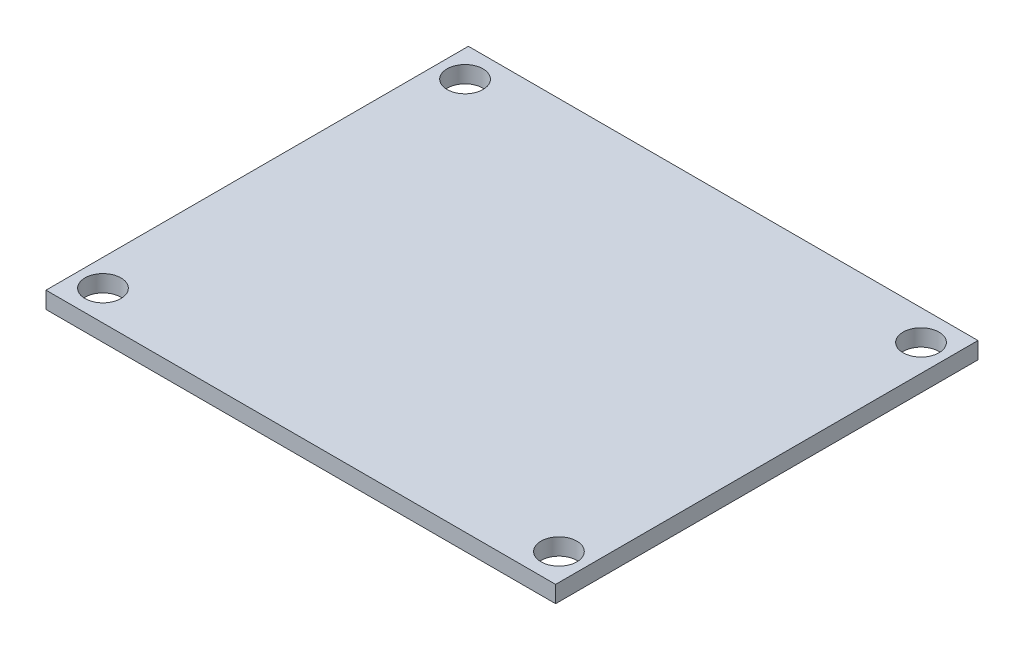
ISO-10303-21;
HEADER;
FILE_DESCRIPTION(('STEP AP214'),'2;1');
FILE_NAME('part.step','',(''),(''),'','','');
FILE_SCHEMA(('AUTOMOTIVE_DESIGN { 1 0 10303 214 1 1 1 1 }'));
ENDSEC;
DATA;
#1=APPLICATION_CONTEXT('core data for automotive mechanical design processes');
#2=APPLICATION_PROTOCOL_DEFINITION('international standard','automotive_design',2000,#1);
#3=PRODUCT_CONTEXT('',#1,'mechanical');
#4=PRODUCT('Part','Part','',(#3));
#5=PRODUCT_RELATED_PRODUCT_CATEGORY('part','',(#4));
#6=PRODUCT_DEFINITION_FORMATION('','',#4);
#7=PRODUCT_DEFINITION_CONTEXT('part definition',#1,'design');
#8=PRODUCT_DEFINITION('design','',#6,#7);
#9=PRODUCT_DEFINITION_SHAPE('','',#8);
#10=(LENGTH_UNIT() NAMED_UNIT(*) SI_UNIT(.MILLI.,.METRE.));
#11=(NAMED_UNIT(*) PLANE_ANGLE_UNIT() SI_UNIT($,.RADIAN.));
#12=(NAMED_UNIT(*) SI_UNIT($,.STERADIAN.) SOLID_ANGLE_UNIT());
#13=UNCERTAINTY_MEASURE_WITH_UNIT(LENGTH_MEASURE(1.E-05),#10,'distance_accuracy_value','');
#14=(GEOMETRIC_REPRESENTATION_CONTEXT(3) GLOBAL_UNCERTAINTY_ASSIGNED_CONTEXT((#13)) GLOBAL_UNIT_ASSIGNED_CONTEXT((#10,
#11,#12)) REPRESENTATION_CONTEXT('',''));
#15=CARTESIAN_POINT('',(0.,0.,0.));
#16=DIRECTION('',(0.,0.,1.));
#17=DIRECTION('',(1.,0.,0.));
#18=AXIS2_PLACEMENT_3D('',#15,#16,#17);
#19=CARTESIAN_POINT('',(-42.7686190505824,1.5875,-22.2551637593528));
#20=DIRECTION('',(1.,0.,0.));
#21=DIRECTION('',(0.,0.,-1.));
#22=AXIS2_PLACEMENT_3D('',#19,#20,#21);
#23=PLANE('',#22);
#24=DIRECTION('',(0.,0.,1.));
#25=VECTOR('',#24,1.);
#26=CARTESIAN_POINT('',(-42.7686190505824,0.,-22.2551637593528));
#27=LINE('',#26,#25);
#28=CARTESIAN_POINT('',(-42.7686190505824,0.,-22.2551637593528));
#29=VERTEX_POINT('',#28);
#30=CARTESIAN_POINT('',(-42.7686190505824,0.,17.7448362406472));
#31=VERTEX_POINT('',#30);
#32=EDGE_CURVE('E103',#29,#31,#27,.T.);
#33=ORIENTED_EDGE('',*,*,#32,.T.);
#34=DIRECTION('',(0.,-1.,0.));
#35=VECTOR('',#34,1.);
#36=CARTESIAN_POINT('',(-42.7686190505824,1.5875,17.7448362406472));
#37=LINE('',#36,#35);
#38=CARTESIAN_POINT('',(-42.7686190505824,1.5875,17.7448362406472));
#39=VERTEX_POINT('',#38);
#40=EDGE_CURVE('E94',#39,#31,#37,.T.);
#41=ORIENTED_EDGE('',*,*,#40,.F.);
#42=DIRECTION('',(0.,0.,1.));
#43=VECTOR('',#42,1.);
#44=CARTESIAN_POINT('',(-42.7686190505824,1.5875,-22.2551637593528));
#45=LINE('',#44,#43);
#46=CARTESIAN_POINT('',(-42.7686190505824,1.5875,-22.2551637593528));
#47=VERTEX_POINT('',#46);
#48=EDGE_CURVE('E88',#47,#39,#45,.T.);
#49=ORIENTED_EDGE('',*,*,#48,.F.);
#50=DIRECTION('',(0.,-1.,0.));
#51=VECTOR('',#50,1.);
#52=CARTESIAN_POINT('',(-42.7686190505824,1.5875,-22.2551637593528));
#53=LINE('',#52,#51);
#54=EDGE_CURVE('E99',#47,#29,#53,.T.);
#55=ORIENTED_EDGE('',*,*,#54,.T.);
#56=EDGE_LOOP('',(#33,#41,#49,#55));
#57=FACE_BOUND('',#56,.T.);
#58=ADVANCED_FACE('F34',(#57),#23,.F.);
#59=CARTESIAN_POINT('',(-42.7686190505824,1.5875,17.7448362406472));
#60=DIRECTION('',(0.,0.,-1.));
#61=DIRECTION('',(-1.,0.,0.));
#62=AXIS2_PLACEMENT_3D('',#59,#60,#61);
#63=PLANE('',#62);
#64=DIRECTION('',(1.,0.,0.));
#65=VECTOR('',#64,1.);
#66=CARTESIAN_POINT('',(-42.7686190505824,0.,17.7448362406472));
#67=LINE('',#66,#65);
#68=CARTESIAN_POINT('',(5.49138094941762,0.,17.7448362406472));
#69=VERTEX_POINT('',#68);
#70=EDGE_CURVE('E93',#31,#69,#67,.T.);
#71=ORIENTED_EDGE('',*,*,#70,.T.);
#72=DIRECTION('',(0.,-1.,0.));
#73=VECTOR('',#72,1.);
#74=CARTESIAN_POINT('',(5.49138094941762,1.5875,17.7448362406472));
#75=LINE('',#74,#73);
#76=CARTESIAN_POINT('',(5.49138094941762,1.5875,17.7448362406472));
#77=VERTEX_POINT('',#76);
#78=EDGE_CURVE('E91',#77,#69,#75,.T.);
#79=ORIENTED_EDGE('',*,*,#78,.F.);
#80=DIRECTION('',(1.,0.,0.));
#81=VECTOR('',#80,1.);
#82=CARTESIAN_POINT('',(-42.7686190505824,1.5875,17.7448362406472));
#83=LINE('',#82,#81);
#84=EDGE_CURVE('E82',#39,#77,#83,.T.);
#85=ORIENTED_EDGE('',*,*,#84,.F.);
#86=ORIENTED_EDGE('',*,*,#40,.T.);
#87=EDGE_LOOP('',(#71,#79,#85,#86));
#88=FACE_BOUND('',#87,.T.);
#89=ADVANCED_FACE('F92',(#88),#63,.F.);
#90=CARTESIAN_POINT('',(5.49138094941762,1.5875,-22.2551637593528));
#91=DIRECTION('',(-1.,0.,0.));
#92=DIRECTION('',(0.,0.,1.));
#93=AXIS2_PLACEMENT_3D('',#90,#91,#92);
#94=PLANE('',#93);
#95=DIRECTION('',(0.,0.,-1.));
#96=VECTOR('',#95,1.);
#97=CARTESIAN_POINT('',(5.49138094941762,0.,-22.2551637593528));
#98=LINE('',#97,#96);
#99=CARTESIAN_POINT('',(5.49138094941762,0.,-22.2551637593528));
#100=VERTEX_POINT('',#99);
#101=EDGE_CURVE('E68',#69,#100,#98,.T.);
#102=ORIENTED_EDGE('',*,*,#101,.T.);
#103=DIRECTION('',(0.,-1.,0.));
#104=VECTOR('',#103,1.);
#105=CARTESIAN_POINT('',(5.49138094941762,1.5875,-22.2551637593528));
#106=LINE('',#105,#104);
#107=CARTESIAN_POINT('',(5.49138094941762,1.5875,-22.2551637593528));
#108=VERTEX_POINT('',#107);
#109=EDGE_CURVE('E95',#108,#100,#106,.T.);
#110=ORIENTED_EDGE('',*,*,#109,.F.);
#111=DIRECTION('',(0.,0.,-1.));
#112=VECTOR('',#111,1.);
#113=CARTESIAN_POINT('',(5.49138094941762,1.5875,-22.2551637593528));
#114=LINE('',#113,#112);
#115=EDGE_CURVE('E86',#77,#108,#114,.T.);
#116=ORIENTED_EDGE('',*,*,#115,.F.);
#117=ORIENTED_EDGE('',*,*,#78,.T.);
#118=EDGE_LOOP('',(#102,#110,#116,#117));
#119=FACE_BOUND('',#118,.T.);
#120=ADVANCED_FACE('F97',(#119),#94,.F.);
#121=CARTESIAN_POINT('',(-42.7686190505824,1.5875,-22.2551637593528));
#122=DIRECTION('',(0.,0.,1.));
#123=DIRECTION('',(1.,0.,0.));
#124=AXIS2_PLACEMENT_3D('',#121,#122,#123);
#125=PLANE('',#124);
#126=DIRECTION('',(-1.,0.,0.));
#127=VECTOR('',#126,1.);
#128=CARTESIAN_POINT('',(-42.7686190505824,0.,-22.2551637593528));
#129=LINE('',#128,#127);
#130=EDGE_CURVE('E74',#100,#29,#129,.T.);
#131=ORIENTED_EDGE('',*,*,#130,.T.);
#132=ORIENTED_EDGE('',*,*,#54,.F.);
#133=DIRECTION('',(-1.,0.,0.));
#134=VECTOR('',#133,1.);
#135=CARTESIAN_POINT('',(-42.7686190505824,1.5875,-22.2551637593528));
#136=LINE('',#135,#134);
#137=EDGE_CURVE('E51',#108,#47,#136,.T.);
#138=ORIENTED_EDGE('',*,*,#137,.F.);
#139=ORIENTED_EDGE('',*,*,#109,.T.);
#140=EDGE_LOOP('',(#131,#132,#138,#139));
#141=FACE_BOUND('',#140,.T.);
#142=ADVANCED_FACE('F128',(#141),#125,.F.);
#143=CARTESIAN_POINT('',(-42.7686190505824,1.5875,17.7448362406472));
#144=DIRECTION('',(0.,1.,0.));
#145=DIRECTION('',(0.,0.,1.));
#146=AXIS2_PLACEMENT_3D('',#143,#144,#145);
#147=PLANE('',#146);
#148=CARTESIAN_POINT('',(2.95138094941762,1.5875,-19.4001637593528));
#149=DIRECTION('',(0.,1.,0.));
#150=DIRECTION('',(0.,0.,1.));
#151=AXIS2_PLACEMENT_3D('',#148,#149,#150);
#152=CIRCLE('',#151,1.7);
#153=CARTESIAN_POINT('',(2.95138094941762,1.5875,-17.7001637593528));
#154=VERTEX_POINT('',#153);
#155=EDGE_CURVE('E172',#154,#154,#152,.T.);
#156=ORIENTED_EDGE('',*,*,#155,.F.);
#157=EDGE_LOOP('',(#156));
#158=FACE_BOUND('',#157,.T.);
#159=CARTESIAN_POINT('',(-40.2286190505824,1.5875,-19.4001637593528));
#160=DIRECTION('',(0.,1.,0.));
#161=DIRECTION('',(0.,0.,1.));
#162=AXIS2_PLACEMENT_3D('',#159,#160,#161);
#163=CIRCLE('',#162,1.7);
#164=CARTESIAN_POINT('',(-40.2286190505824,1.5875,-17.7001637593528));
#165=VERTEX_POINT('',#164);
#166=EDGE_CURVE('E116',#165,#165,#163,.T.);
#167=ORIENTED_EDGE('',*,*,#166,.F.);
#168=EDGE_LOOP('',(#167));
#169=FACE_BOUND('',#168,.T.);
#170=ORIENTED_EDGE('',*,*,#48,.T.);
#171=ORIENTED_EDGE('',*,*,#84,.T.);
#172=ORIENTED_EDGE('',*,*,#115,.T.);
#173=ORIENTED_EDGE('',*,*,#137,.T.);
#174=EDGE_LOOP('',(#170,#171,#172,#173));
#175=FACE_BOUND('',#174,.T.);
#176=CARTESIAN_POINT('',(-40.2286190505824,1.5875,14.8898362406472));
#177=DIRECTION('',(0.,1.,0.));
#178=DIRECTION('',(0.,0.,1.));
#179=AXIS2_PLACEMENT_3D('',#176,#177,#178);
#180=CIRCLE('',#179,1.7);
#181=CARTESIAN_POINT('',(-40.2286190505824,1.5875,16.5898362406472));
#182=VERTEX_POINT('',#181);
#183=EDGE_CURVE('E113',#182,#182,#180,.T.);
#184=ORIENTED_EDGE('',*,*,#183,.F.);
#185=EDGE_LOOP('',(#184));
#186=FACE_BOUND('',#185,.T.);
#187=CARTESIAN_POINT('',(2.95138094941763,1.5875,14.8898362406472));
#188=DIRECTION('',(0.,1.,0.));
#189=DIRECTION('',(0.,0.,1.));
#190=AXIS2_PLACEMENT_3D('',#187,#188,#189);
#191=CIRCLE('',#190,1.7);
#192=CARTESIAN_POINT('',(2.95138094941763,1.5875,16.5898362406472));
#193=VERTEX_POINT('',#192);
#194=EDGE_CURVE('E43',#193,#193,#191,.T.);
#195=ORIENTED_EDGE('',*,*,#194,.F.);
#196=EDGE_LOOP('',(#195));
#197=FACE_BOUND('',#196,.T.);
#198=ADVANCED_FACE('F83',(#158,#169,#175,#186,#197),#147,.T.);
#199=CARTESIAN_POINT('',(-42.7686190505824,0.,17.7448362406472));
#200=DIRECTION('',(0.,1.,0.));
#201=DIRECTION('',(0.,0.,1.));
#202=AXIS2_PLACEMENT_3D('',#199,#200,#201);
#203=PLANE('',#202);
#204=CARTESIAN_POINT('',(2.95138094941762,0.,-19.4001637593528));
#205=DIRECTION('',(0.,1.,0.));
#206=DIRECTION('',(0.,0.,1.));
#207=AXIS2_PLACEMENT_3D('',#204,#205,#206);
#208=CIRCLE('',#207,1.7);
#209=CARTESIAN_POINT('',(2.95138094941762,0.,-17.7001637593528));
#210=VERTEX_POINT('',#209);
#211=EDGE_CURVE('E175',#210,#210,#208,.T.);
#212=ORIENTED_EDGE('',*,*,#211,.T.);
#213=EDGE_LOOP('',(#212));
#214=FACE_BOUND('',#213,.T.);
#215=CARTESIAN_POINT('',(-40.2286190505824,0.,-19.4001637593528));
#216=DIRECTION('',(0.,1.,0.));
#217=DIRECTION('',(0.,0.,1.));
#218=AXIS2_PLACEMENT_3D('',#215,#216,#217);
#219=CIRCLE('',#218,1.7);
#220=CARTESIAN_POINT('',(-40.2286190505824,0.,-17.7001637593528));
#221=VERTEX_POINT('',#220);
#222=EDGE_CURVE('E106',#221,#221,#219,.T.);
#223=ORIENTED_EDGE('',*,*,#222,.T.);
#224=EDGE_LOOP('',(#223));
#225=FACE_BOUND('',#224,.T.);
#226=ORIENTED_EDGE('',*,*,#32,.F.);
#227=ORIENTED_EDGE('',*,*,#130,.F.);
#228=ORIENTED_EDGE('',*,*,#101,.F.);
#229=ORIENTED_EDGE('',*,*,#70,.F.);
#230=EDGE_LOOP('',(#226,#227,#228,#229));
#231=FACE_BOUND('',#230,.T.);
#232=CARTESIAN_POINT('',(-40.2286190505824,0.,14.8898362406472));
#233=DIRECTION('',(0.,1.,0.));
#234=DIRECTION('',(0.,0.,1.));
#235=AXIS2_PLACEMENT_3D('',#232,#233,#234);
#236=CIRCLE('',#235,1.7);
#237=CARTESIAN_POINT('',(-40.2286190505824,0.,16.5898362406472));
#238=VERTEX_POINT('',#237);
#239=EDGE_CURVE('E119',#238,#238,#236,.T.);
#240=ORIENTED_EDGE('',*,*,#239,.T.);
#241=EDGE_LOOP('',(#240));
#242=FACE_BOUND('',#241,.T.);
#243=CARTESIAN_POINT('',(2.95138094941763,0.,14.8898362406472));
#244=DIRECTION('',(0.,1.,0.));
#245=DIRECTION('',(0.,0.,1.));
#246=AXIS2_PLACEMENT_3D('',#243,#244,#245);
#247=CIRCLE('',#246,1.7);
#248=CARTESIAN_POINT('',(2.95138094941763,0.,16.5898362406472));
#249=VERTEX_POINT('',#248);
#250=EDGE_CURVE('E11',#249,#249,#247,.T.);
#251=ORIENTED_EDGE('',*,*,#250,.T.);
#252=EDGE_LOOP('',(#251));
#253=FACE_BOUND('',#252,.T.);
#254=ADVANCED_FACE('F127',(#214,#225,#231,#242,#253),#203,.F.);
#255=CARTESIAN_POINT('',(-40.2286190505824,1.5875,-19.4001637593528));
#256=DIRECTION('',(0.,1.,0.));
#257=DIRECTION('',(0.,0.,1.));
#258=AXIS2_PLACEMENT_3D('',#255,#256,#257);
#259=CYLINDRICAL_SURFACE('',#258,1.7);
#260=ORIENTED_EDGE('',*,*,#166,.T.);
#261=EDGE_LOOP('',(#260));
#262=FACE_BOUND('',#261,.T.);
#263=ORIENTED_EDGE('',*,*,#222,.F.);
#264=EDGE_LOOP('',(#263));
#265=FACE_BOUND('',#264,.T.);
#266=ADVANCED_FACE('F135',(#262,#265),#259,.F.);
#267=CARTESIAN_POINT('',(2.95138094941762,1.5875,-19.4001637593528));
#268=DIRECTION('',(0.,1.,0.));
#269=DIRECTION('',(0.,0.,1.));
#270=AXIS2_PLACEMENT_3D('',#267,#268,#269);
#271=CYLINDRICAL_SURFACE('',#270,1.7);
#272=ORIENTED_EDGE('',*,*,#155,.T.);
#273=EDGE_LOOP('',(#272));
#274=FACE_BOUND('',#273,.T.);
#275=ORIENTED_EDGE('',*,*,#211,.F.);
#276=EDGE_LOOP('',(#275));
#277=FACE_BOUND('',#276,.T.);
#278=ADVANCED_FACE('F152',(#274,#277),#271,.F.);
#279=CARTESIAN_POINT('',(-40.2286190505824,1.5875,14.8898362406472));
#280=DIRECTION('',(0.,1.,0.));
#281=DIRECTION('',(0.,0.,1.));
#282=AXIS2_PLACEMENT_3D('',#279,#280,#281);
#283=CYLINDRICAL_SURFACE('',#282,1.7);
#284=ORIENTED_EDGE('',*,*,#183,.T.);
#285=EDGE_LOOP('',(#284));
#286=FACE_BOUND('',#285,.T.);
#287=ORIENTED_EDGE('',*,*,#239,.F.);
#288=EDGE_LOOP('',(#287));
#289=FACE_BOUND('',#288,.T.);
#290=ADVANCED_FACE('F150',(#286,#289),#283,.F.);
#291=CARTESIAN_POINT('',(2.95138094941763,1.5875,14.8898362406472));
#292=DIRECTION('',(0.,1.,0.));
#293=DIRECTION('',(0.,0.,1.));
#294=AXIS2_PLACEMENT_3D('',#291,#292,#293);
#295=CYLINDRICAL_SURFACE('',#294,1.7);
#296=ORIENTED_EDGE('',*,*,#194,.T.);
#297=EDGE_LOOP('',(#296));
#298=FACE_BOUND('',#297,.T.);
#299=ORIENTED_EDGE('',*,*,#250,.F.);
#300=EDGE_LOOP('',(#299));
#301=FACE_BOUND('',#300,.T.);
#302=ADVANCED_FACE('F36',(#298,#301),#295,.F.);
#303=CLOSED_SHELL('',(#58,#89,#120,#142,#198,#254,#266,#278,#290,#302));
#304=MANIFOLD_SOLID_BREP('B2',#303);
#305=ADVANCED_BREP_SHAPE_REPRESENTATION('',(#18,#304),#14);
#306=SHAPE_DEFINITION_REPRESENTATION(#9,#305);
ENDSEC;
END-ISO-10303-21;
